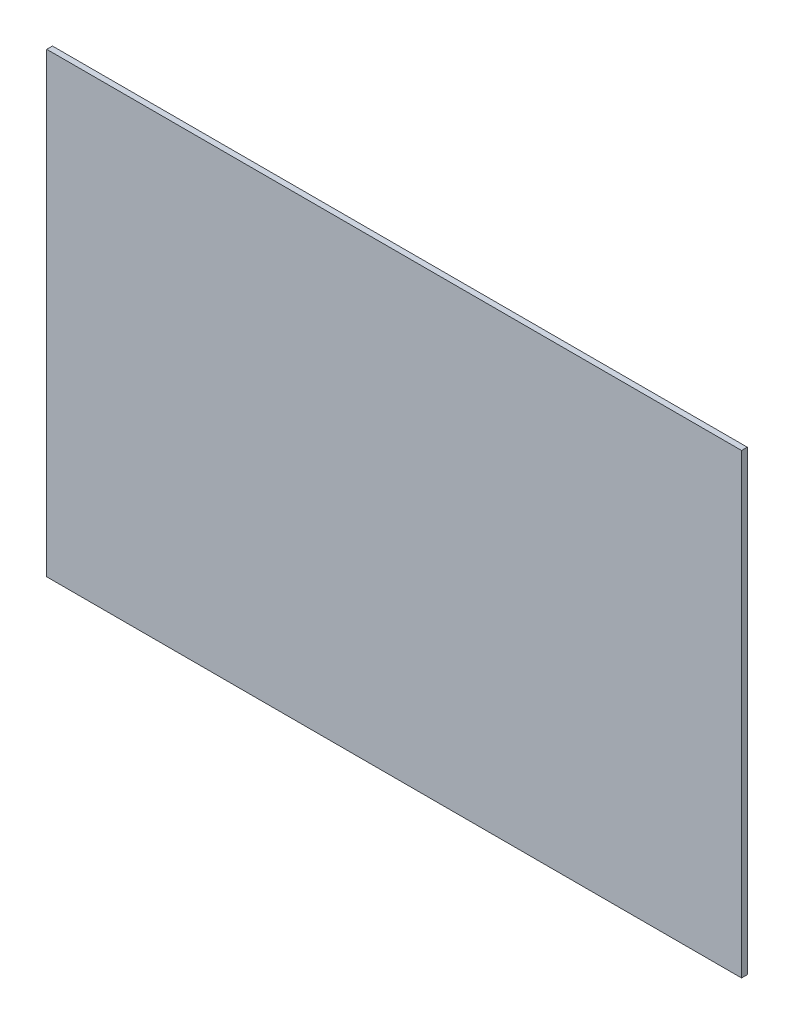
ISO-10303-21;
HEADER;
FILE_DESCRIPTION(('STEP AP214'),'2;1');
FILE_NAME('part.step','',(''),(''),'','','');
FILE_SCHEMA(('AUTOMOTIVE_DESIGN { 1 0 10303 214 1 1 1 1 }'));
ENDSEC;
DATA;
#1=APPLICATION_CONTEXT('core data for automotive mechanical design processes');
#2=APPLICATION_PROTOCOL_DEFINITION('international standard','automotive_design',2000,#1);
#3=PRODUCT_CONTEXT('',#1,'mechanical');
#4=PRODUCT('Part','Part','',(#3));
#5=PRODUCT_RELATED_PRODUCT_CATEGORY('part','',(#4));
#6=PRODUCT_DEFINITION_FORMATION('','',#4);
#7=PRODUCT_DEFINITION_CONTEXT('part definition',#1,'design');
#8=PRODUCT_DEFINITION('design','',#6,#7);
#9=PRODUCT_DEFINITION_SHAPE('','',#8);
#10=(LENGTH_UNIT() NAMED_UNIT(*) SI_UNIT(.MILLI.,.METRE.));
#11=(NAMED_UNIT(*) PLANE_ANGLE_UNIT() SI_UNIT($,.RADIAN.));
#12=(NAMED_UNIT(*) SI_UNIT($,.STERADIAN.) SOLID_ANGLE_UNIT());
#13=UNCERTAINTY_MEASURE_WITH_UNIT(LENGTH_MEASURE(1.E-05),#10,'distance_accuracy_value','');
#14=(GEOMETRIC_REPRESENTATION_CONTEXT(3) GLOBAL_UNCERTAINTY_ASSIGNED_CONTEXT((#13)) GLOBAL_UNIT_ASSIGNED_CONTEXT((#10,
#11,#12)) REPRESENTATION_CONTEXT('',''));
#15=CARTESIAN_POINT('',(0.,0.,0.));
#16=DIRECTION('',(0.,0.,1.));
#17=DIRECTION('',(1.,0.,0.));
#18=AXIS2_PLACEMENT_3D('',#15,#16,#17);
#19=CARTESIAN_POINT('',(0.,0.,-11.37));
#20=DIRECTION('',(0.,0.,1.));
#21=DIRECTION('',(1.,0.,0.));
#22=AXIS2_PLACEMENT_3D('',#19,#20,#21);
#23=PLANE('',#22);
#24=DIRECTION('',(1.,0.,0.));
#25=VECTOR('',#24,1.);
#26=CARTESIAN_POINT('',(-5.416578518674,4.,-11.37));
#27=LINE('',#26,#25);
#28=CARTESIAN_POINT('',(-17.58342148133,4.,-11.37));
#29=VERTEX_POINT('',#28);
#30=CARTESIAN_POINT('',(-5.416578518674,4.,-11.37));
#31=VERTEX_POINT('',#30);
#32=EDGE_CURVE('E68',#29,#31,#27,.T.);
#33=ORIENTED_EDGE('',*,*,#32,.F.);
#34=DIRECTION('',(0.,1.,0.));
#35=VECTOR('',#34,1.);
#36=CARTESIAN_POINT('',(-17.58342148133,4.,-11.37));
#37=LINE('',#36,#35);
#38=CARTESIAN_POINT('',(-17.58342148133,-4.,-11.37));
#39=VERTEX_POINT('',#38);
#40=EDGE_CURVE('E20',#39,#29,#37,.T.);
#41=ORIENTED_EDGE('',*,*,#40,.F.);
#42=DIRECTION('',(1.,0.,0.));
#43=VECTOR('',#42,1.);
#44=CARTESIAN_POINT('',(-17.58342148133,-4.,-11.37));
#45=LINE('',#44,#43);
#46=CARTESIAN_POINT('',(-5.416578518674,-4.,-11.37));
#47=VERTEX_POINT('',#46);
#48=EDGE_CURVE('E58',#47,#39,#45,.F.);
#49=ORIENTED_EDGE('',*,*,#48,.F.);
#50=DIRECTION('',(0.,1.,0.));
#51=VECTOR('',#50,1.);
#52=CARTESIAN_POINT('',(-5.416578518674,-4.,-11.37));
#53=LINE('',#52,#51);
#54=EDGE_CURVE('E53',#31,#47,#53,.F.);
#55=ORIENTED_EDGE('',*,*,#54,.F.);
#56=EDGE_LOOP('',(#33,#41,#49,#55));
#57=FACE_BOUND('',#56,.T.);
#58=ADVANCED_FACE('F17',(#57),#23,.T.);
#59=CARTESIAN_POINT('',(-17.58342148133,4.,-11.47));
#60=DIRECTION('',(-1.,0.,0.));
#61=DIRECTION('',(0.,0.,1.));
#62=AXIS2_PLACEMENT_3D('',#59,#60,#61);
#63=PLANE('',#62);
#64=DIRECTION('',(0.,0.,1.));
#65=VECTOR('',#64,1.);
#66=CARTESIAN_POINT('',(-17.58342148133,4.,-11.47));
#67=LINE('',#66,#65);
#68=CARTESIAN_POINT('',(-17.58342148133,4.,-11.47));
#69=VERTEX_POINT('',#68);
#70=EDGE_CURVE('E79',#69,#29,#67,.T.);
#71=ORIENTED_EDGE('',*,*,#70,.F.);
#72=DIRECTION('',(0.,1.,0.));
#73=VECTOR('',#72,1.);
#74=CARTESIAN_POINT('',(-17.58342148133,0.,-11.47));
#75=LINE('',#74,#73);
#76=CARTESIAN_POINT('',(-17.58342148133,-4.,-11.47));
#77=VERTEX_POINT('',#76);
#78=EDGE_CURVE('E74',#69,#77,#75,.F.);
#79=ORIENTED_EDGE('',*,*,#78,.T.);
#80=DIRECTION('',(0.,0.,-1.));
#81=VECTOR('',#80,1.);
#82=CARTESIAN_POINT('',(-17.58342148133,-4.,-11.47));
#83=LINE('',#82,#81);
#84=EDGE_CURVE('E63',#39,#77,#83,.T.);
#85=ORIENTED_EDGE('',*,*,#84,.F.);
#86=ORIENTED_EDGE('',*,*,#40,.T.);
#87=EDGE_LOOP('',(#71,#79,#85,#86));
#88=FACE_BOUND('',#87,.T.);
#89=ADVANCED_FACE('F73',(#88),#63,.T.);
#90=CARTESIAN_POINT('',(-17.58342148133,-4.,-11.47));
#91=DIRECTION('',(0.,-1.,0.));
#92=DIRECTION('',(0.,0.,-1.));
#93=AXIS2_PLACEMENT_3D('',#90,#91,#92);
#94=PLANE('',#93);
#95=ORIENTED_EDGE('',*,*,#84,.T.);
#96=DIRECTION('',(1.,0.,0.));
#97=VECTOR('',#96,1.);
#98=CARTESIAN_POINT('',(0.,-4.,-11.47));
#99=LINE('',#98,#97);
#100=CARTESIAN_POINT('',(-5.416578518674,-4.,-11.47));
#101=VERTEX_POINT('',#100);
#102=EDGE_CURVE('E84',#77,#101,#99,.T.);
#103=ORIENTED_EDGE('',*,*,#102,.T.);
#104=DIRECTION('',(0.,0.,-1.));
#105=VECTOR('',#104,1.);
#106=CARTESIAN_POINT('',(-5.416578518674,-4.,-11.47));
#107=LINE('',#106,#105);
#108=EDGE_CURVE('E65',#47,#101,#107,.T.);
#109=ORIENTED_EDGE('',*,*,#108,.F.);
#110=ORIENTED_EDGE('',*,*,#48,.T.);
#111=EDGE_LOOP('',(#95,#103,#109,#110));
#112=FACE_BOUND('',#111,.T.);
#113=ADVANCED_FACE('F60',(#112),#94,.T.);
#114=CARTESIAN_POINT('',(-5.416578518674,-4.,-11.47));
#115=DIRECTION('',(1.,0.,0.));
#116=DIRECTION('',(0.,0.,-1.));
#117=AXIS2_PLACEMENT_3D('',#114,#115,#116);
#118=PLANE('',#117);
#119=ORIENTED_EDGE('',*,*,#108,.T.);
#120=DIRECTION('',(0.,1.,0.));
#121=VECTOR('',#120,1.);
#122=CARTESIAN_POINT('',(-5.416578518674,0.,-11.47));
#123=LINE('',#122,#121);
#124=CARTESIAN_POINT('',(-5.416578518674,4.,-11.47));
#125=VERTEX_POINT('',#124);
#126=EDGE_CURVE('E26',#101,#125,#123,.T.);
#127=ORIENTED_EDGE('',*,*,#126,.T.);
#128=DIRECTION('',(0.,0.,1.));
#129=VECTOR('',#128,1.);
#130=CARTESIAN_POINT('',(-5.416578518674,4.,-11.47));
#131=LINE('',#130,#129);
#132=EDGE_CURVE('E34',#31,#125,#131,.F.);
#133=ORIENTED_EDGE('',*,*,#132,.F.);
#134=ORIENTED_EDGE('',*,*,#54,.T.);
#135=EDGE_LOOP('',(#119,#127,#133,#134));
#136=FACE_BOUND('',#135,.T.);
#137=ADVANCED_FACE('F88',(#136),#118,.T.);
#138=CARTESIAN_POINT('',(-5.416578518674,4.,-11.47));
#139=DIRECTION('',(0.,1.,0.));
#140=DIRECTION('',(0.,0.,1.));
#141=AXIS2_PLACEMENT_3D('',#138,#139,#140);
#142=PLANE('',#141);
#143=ORIENTED_EDGE('',*,*,#132,.T.);
#144=DIRECTION('',(1.,0.,0.));
#145=VECTOR('',#144,1.);
#146=CARTESIAN_POINT('',(0.,4.,-11.47));
#147=LINE('',#146,#145);
#148=EDGE_CURVE('E11',#125,#69,#147,.F.);
#149=ORIENTED_EDGE('',*,*,#148,.T.);
#150=ORIENTED_EDGE('',*,*,#70,.T.);
#151=ORIENTED_EDGE('',*,*,#32,.T.);
#152=EDGE_LOOP('',(#143,#149,#150,#151));
#153=FACE_BOUND('',#152,.T.);
#154=ADVANCED_FACE('F91',(#153),#142,.T.);
#155=CARTESIAN_POINT('',(0.,0.,-11.47));
#156=DIRECTION('',(0.,0.,1.));
#157=DIRECTION('',(1.,0.,0.));
#158=AXIS2_PLACEMENT_3D('',#155,#156,#157);
#159=PLANE('',#158);
#160=ORIENTED_EDGE('',*,*,#126,.F.);
#161=ORIENTED_EDGE('',*,*,#102,.F.);
#162=ORIENTED_EDGE('',*,*,#78,.F.);
#163=ORIENTED_EDGE('',*,*,#148,.F.);
#164=EDGE_LOOP('',(#160,#161,#162,#163));
#165=FACE_BOUND('',#164,.T.);
#166=ADVANCED_FACE('F90',(#165),#159,.F.);
#167=CLOSED_SHELL('',(#58,#89,#113,#137,#154,#166));
#168=MANIFOLD_SOLID_BREP('B1',#167);
#169=ADVANCED_BREP_SHAPE_REPRESENTATION('',(#18,#168),#14);
#170=SHAPE_DEFINITION_REPRESENTATION(#9,#169);
ENDSEC;
END-ISO-10303-21;
